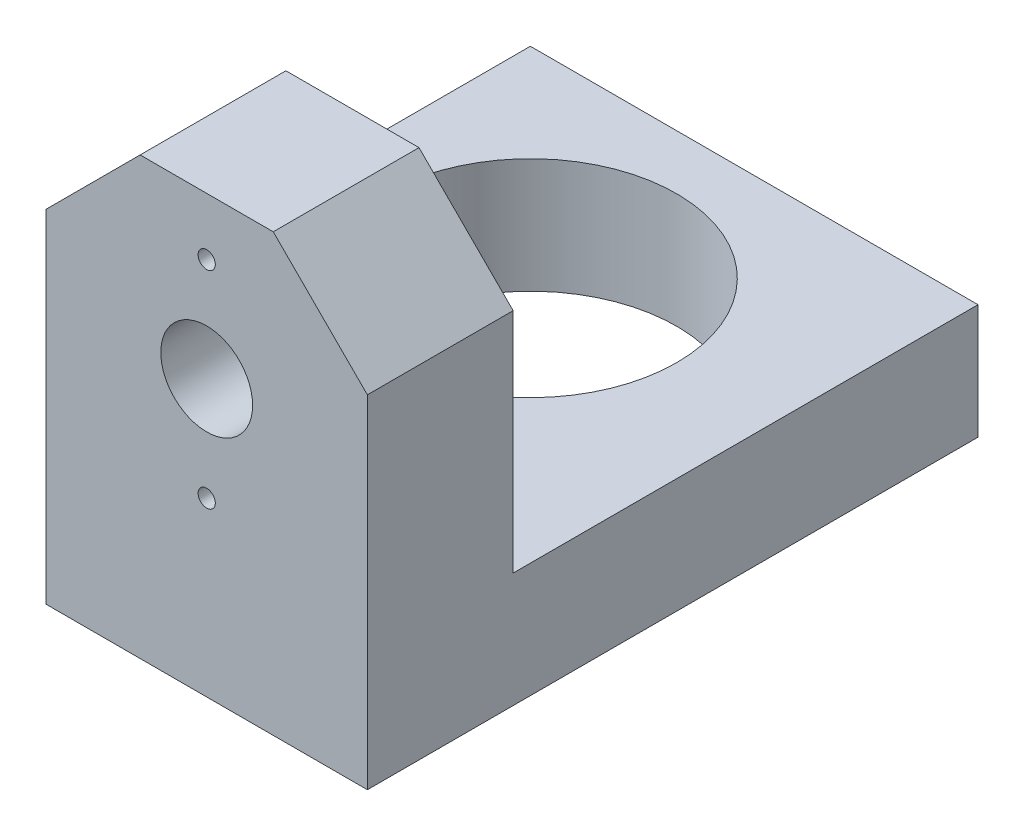
ISO-10303-21;
HEADER;
FILE_DESCRIPTION(('STEP AP214'),'2;1');
FILE_NAME('part.step','',(''),(''),'','','');
FILE_SCHEMA(('AUTOMOTIVE_DESIGN { 1 0 10303 214 1 1 1 1 }'));
ENDSEC;
DATA;
#1=APPLICATION_CONTEXT('core data for automotive mechanical design processes');
#2=APPLICATION_PROTOCOL_DEFINITION('international standard','automotive_design',2000,#1);
#3=PRODUCT_CONTEXT('',#1,'mechanical');
#4=PRODUCT('Part','Part','',(#3));
#5=PRODUCT_RELATED_PRODUCT_CATEGORY('part','',(#4));
#6=PRODUCT_DEFINITION_FORMATION('','',#4);
#7=PRODUCT_DEFINITION_CONTEXT('part definition',#1,'design');
#8=PRODUCT_DEFINITION('design','',#6,#7);
#9=PRODUCT_DEFINITION_SHAPE('','',#8);
#10=(LENGTH_UNIT() NAMED_UNIT(*) SI_UNIT(.MILLI.,.METRE.));
#11=(NAMED_UNIT(*) PLANE_ANGLE_UNIT() SI_UNIT($,.RADIAN.));
#12=(NAMED_UNIT(*) SI_UNIT($,.STERADIAN.) SOLID_ANGLE_UNIT());
#13=UNCERTAINTY_MEASURE_WITH_UNIT(LENGTH_MEASURE(1.E-05),#10,'distance_accuracy_value','');
#14=(GEOMETRIC_REPRESENTATION_CONTEXT(3) GLOBAL_UNCERTAINTY_ASSIGNED_CONTEXT((#13)) GLOBAL_UNIT_ASSIGNED_CONTEXT((#10,
#11,#12)) REPRESENTATION_CONTEXT('',''));
#15=CARTESIAN_POINT('',(0.,0.,0.));
#16=DIRECTION('',(0.,0.,1.));
#17=DIRECTION('',(1.,0.,0.));
#18=AXIS2_PLACEMENT_3D('',#15,#16,#17);
#19=CARTESIAN_POINT('',(0.,0.,12.7));
#20=DIRECTION('',(0.,0.,-1.));
#21=DIRECTION('',(-1.,0.,0.));
#22=AXIS2_PLACEMENT_3D('',#19,#20,#21);
#23=PLANE('',#22);
#24=DIRECTION('',(-0.707106781186549,-0.707106781186546,0.));
#25=VECTOR('',#24,1.);
#26=CARTESIAN_POINT('',(-14.,5.79898987322334,12.7));
#27=LINE('',#26,#25);
#28=CARTESIAN_POINT('',(-5.79898987322334,14.,12.7));
#29=VERTEX_POINT('',#28);
#30=CARTESIAN_POINT('',(-14.,5.79898987322334,12.7));
#31=VERTEX_POINT('',#30);
#32=EDGE_CURVE('E238',#29,#31,#27,.T.);
#33=ORIENTED_EDGE('',*,*,#32,.T.);
#34=DIRECTION('',(0.,-1.,0.));
#35=VECTOR('',#34,1.);
#36=CARTESIAN_POINT('',(-14.,-5.79898987322334,12.7));
#37=LINE('',#36,#35);
#38=CARTESIAN_POINT('',(-14.,-24.,12.7));
#39=VERTEX_POINT('',#38);
#40=EDGE_CURVE('E112',#31,#39,#37,.T.);
#41=ORIENTED_EDGE('',*,*,#40,.T.);
#42=DIRECTION('',(-1.,0.,0.));
#43=VECTOR('',#42,1.);
#44=CARTESIAN_POINT('',(14.,-24.,12.7));
#45=LINE('',#44,#43);
#46=CARTESIAN_POINT('',(14.,-24.,12.7));
#47=VERTEX_POINT('',#46);
#48=EDGE_CURVE('E190',#47,#39,#45,.T.);
#49=ORIENTED_EDGE('',*,*,#48,.F.);
#50=DIRECTION('',(0.,1.,0.));
#51=VECTOR('',#50,1.);
#52=CARTESIAN_POINT('',(14.,-14.,12.7));
#53=LINE('',#52,#51);
#54=CARTESIAN_POINT('',(14.,5.79898987322334,12.7));
#55=VERTEX_POINT('',#54);
#56=EDGE_CURVE('E243',#47,#55,#53,.T.);
#57=ORIENTED_EDGE('',*,*,#56,.T.);
#58=DIRECTION('',(-0.707106781186549,0.707106781186546,0.));
#59=VECTOR('',#58,1.);
#60=CARTESIAN_POINT('',(5.79898987322334,14.,12.7));
#61=LINE('',#60,#59);
#62=CARTESIAN_POINT('',(5.79898987322334,14.,12.7));
#63=VERTEX_POINT('',#62);
#64=EDGE_CURVE('E246',#55,#63,#61,.T.);
#65=ORIENTED_EDGE('',*,*,#64,.T.);
#66=DIRECTION('',(-1.,0.,0.));
#67=VECTOR('',#66,1.);
#68=CARTESIAN_POINT('',(-5.79898987322334,14.,12.7));
#69=LINE('',#68,#67);
#70=EDGE_CURVE('E78',#63,#29,#69,.T.);
#71=ORIENTED_EDGE('',*,*,#70,.T.);
#72=EDGE_LOOP('',(#33,#41,#49,#57,#65,#71));
#73=FACE_BOUND('',#72,.T.);
#74=CARTESIAN_POINT('',(0.,0.,12.7));
#75=DIRECTION('',(0.,0.,1.));
#76=DIRECTION('',(1.,0.,0.));
#77=AXIS2_PLACEMENT_3D('',#74,#75,#76);
#78=CIRCLE('',#77,4.);
#79=CARTESIAN_POINT('',(4.,0.,12.7));
#80=VERTEX_POINT('',#79);
#81=EDGE_CURVE('E230',#80,#80,#78,.T.);
#82=ORIENTED_EDGE('',*,*,#81,.F.);
#83=EDGE_LOOP('',(#82));
#84=FACE_BOUND('',#83,.T.);
#85=CARTESIAN_POINT('',(0.,9.,12.7));
#86=DIRECTION('',(0.,0.,1.));
#87=DIRECTION('',(1.,0.,0.));
#88=AXIS2_PLACEMENT_3D('',#85,#86,#87);
#89=CIRCLE('',#88,0.75);
#90=CARTESIAN_POINT('',(0.75,9.,12.7));
#91=VERTEX_POINT('',#90);
#92=EDGE_CURVE('E222',#91,#91,#89,.T.);
#93=ORIENTED_EDGE('',*,*,#92,.F.);
#94=EDGE_LOOP('',(#93));
#95=FACE_BOUND('',#94,.T.);
#96=CARTESIAN_POINT('',(0.,-9.,12.7));
#97=DIRECTION('',(0.,0.,1.));
#98=DIRECTION('',(1.,0.,0.));
#99=AXIS2_PLACEMENT_3D('',#96,#97,#98);
#100=CIRCLE('',#99,0.75);
#101=CARTESIAN_POINT('',(0.75,-9.,12.7));
#102=VERTEX_POINT('',#101);
#103=EDGE_CURVE('E214',#102,#102,#100,.T.);
#104=ORIENTED_EDGE('',*,*,#103,.F.);
#105=EDGE_LOOP('',(#104));
#106=FACE_BOUND('',#105,.T.);
#107=ADVANCED_FACE('F60',(#73,#84,#95,#106),#23,.F.);
#108=CARTESIAN_POINT('',(0.,0.,0.));
#109=DIRECTION('',(0.,0.,-1.));
#110=DIRECTION('',(-1.,0.,0.));
#111=AXIS2_PLACEMENT_3D('',#108,#109,#110);
#112=PLANE('',#111);
#113=CARTESIAN_POINT('',(0.,9.,0.));
#114=DIRECTION('',(0.,0.,1.));
#115=DIRECTION('',(1.,0.,0.));
#116=AXIS2_PLACEMENT_3D('',#113,#114,#115);
#117=CIRCLE('',#116,0.75);
#118=CARTESIAN_POINT('',(0.75,9.,0.));
#119=VERTEX_POINT('',#118);
#120=EDGE_CURVE('E218',#119,#119,#117,.T.);
#121=ORIENTED_EDGE('',*,*,#120,.T.);
#122=EDGE_LOOP('',(#121));
#123=FACE_BOUND('',#122,.T.);
#124=DIRECTION('',(-0.707106781186549,-0.707106781186546,0.));
#125=VECTOR('',#124,1.);
#126=CARTESIAN_POINT('',(-14.,5.79898987322334,0.));
#127=LINE('',#126,#125);
#128=CARTESIAN_POINT('',(-5.79898987322334,14.,0.));
#129=VERTEX_POINT('',#128);
#130=CARTESIAN_POINT('',(-14.,5.79898987322334,0.));
#131=VERTEX_POINT('',#130);
#132=EDGE_CURVE('E234',#129,#131,#127,.T.);
#133=ORIENTED_EDGE('',*,*,#132,.F.);
#134=DIRECTION('',(-1.,0.,0.));
#135=VECTOR('',#134,1.);
#136=CARTESIAN_POINT('',(-5.79898987322334,14.,0.));
#137=LINE('',#136,#135);
#138=CARTESIAN_POINT('',(5.79898987322334,14.,0.));
#139=VERTEX_POINT('',#138);
#140=EDGE_CURVE('E105',#139,#129,#137,.T.);
#141=ORIENTED_EDGE('',*,*,#140,.F.);
#142=DIRECTION('',(-0.707106781186549,0.707106781186546,0.));
#143=VECTOR('',#142,1.);
#144=CARTESIAN_POINT('',(5.79898987322334,14.,0.));
#145=LINE('',#144,#143);
#146=CARTESIAN_POINT('',(14.,5.79898987322334,0.));
#147=VERTEX_POINT('',#146);
#148=EDGE_CURVE('E99',#147,#139,#145,.T.);
#149=ORIENTED_EDGE('',*,*,#148,.F.);
#150=DIRECTION('',(0.,1.,0.));
#151=VECTOR('',#150,1.);
#152=CARTESIAN_POINT('',(14.,5.79898987322334,0.));
#153=LINE('',#152,#151);
#154=CARTESIAN_POINT('',(14.,-14.,0.));
#155=VERTEX_POINT('',#154);
#156=EDGE_CURVE('E263',#155,#147,#153,.T.);
#157=ORIENTED_EDGE('',*,*,#156,.F.);
#158=DIRECTION('',(1.,0.,0.));
#159=VECTOR('',#158,1.);
#160=CARTESIAN_POINT('',(5.79898987322334,-14.,0.));
#161=LINE('',#160,#159);
#162=CARTESIAN_POINT('',(-14.,-14.,0.));
#163=VERTEX_POINT('',#162);
#164=EDGE_CURVE('E259',#163,#155,#161,.T.);
#165=ORIENTED_EDGE('',*,*,#164,.F.);
#166=DIRECTION('',(0.,-1.,0.));
#167=VECTOR('',#166,1.);
#168=CARTESIAN_POINT('',(-14.,-5.79898987322334,0.));
#169=LINE('',#168,#167);
#170=EDGE_CURVE('E255',#131,#163,#169,.T.);
#171=ORIENTED_EDGE('',*,*,#170,.F.);
#172=EDGE_LOOP('',(#133,#141,#149,#157,#165,#171));
#173=FACE_BOUND('',#172,.T.);
#174=CARTESIAN_POINT('',(0.,0.,0.));
#175=DIRECTION('',(0.,0.,1.));
#176=DIRECTION('',(1.,0.,0.));
#177=AXIS2_PLACEMENT_3D('',#174,#175,#176);
#178=CIRCLE('',#177,4.);
#179=CARTESIAN_POINT('',(4.,0.,0.));
#180=VERTEX_POINT('',#179);
#181=EDGE_CURVE('E226',#180,#180,#178,.T.);
#182=ORIENTED_EDGE('',*,*,#181,.T.);
#183=EDGE_LOOP('',(#182));
#184=FACE_BOUND('',#183,.T.);
#185=CARTESIAN_POINT('',(0.,-9.,0.));
#186=DIRECTION('',(0.,0.,1.));
#187=DIRECTION('',(1.,0.,0.));
#188=AXIS2_PLACEMENT_3D('',#185,#186,#187);
#189=CIRCLE('',#188,0.75);
#190=CARTESIAN_POINT('',(0.75,-9.,0.));
#191=VERTEX_POINT('',#190);
#192=EDGE_CURVE('E207',#191,#191,#189,.T.);
#193=ORIENTED_EDGE('',*,*,#192,.T.);
#194=EDGE_LOOP('',(#193));
#195=FACE_BOUND('',#194,.T.);
#196=ADVANCED_FACE('F281',(#123,#173,#184,#195),#112,.T.);
#197=CARTESIAN_POINT('',(-14.,5.79898987322334,12.7));
#198=DIRECTION('',(0.707106781186546,-0.707106781186549,0.));
#199=DIRECTION('',(0.707106781186549,0.707106781186546,0.));
#200=AXIS2_PLACEMENT_3D('',#197,#198,#199);
#201=PLANE('',#200);
#202=ORIENTED_EDGE('',*,*,#132,.T.);
#203=DIRECTION('',(0.,0.,-1.));
#204=VECTOR('',#203,1.);
#205=CARTESIAN_POINT('',(-14.,5.79898987322334,12.7));
#206=LINE('',#205,#204);
#207=EDGE_CURVE('E12',#31,#131,#206,.T.);
#208=ORIENTED_EDGE('',*,*,#207,.F.);
#209=ORIENTED_EDGE('',*,*,#32,.F.);
#210=DIRECTION('',(0.,0.,-1.));
#211=VECTOR('',#210,1.);
#212=CARTESIAN_POINT('',(-5.79898987322334,14.,12.7));
#213=LINE('',#212,#211);
#214=EDGE_CURVE('E251',#29,#129,#213,.T.);
#215=ORIENTED_EDGE('',*,*,#214,.T.);
#216=EDGE_LOOP('',(#202,#208,#209,#215));
#217=FACE_BOUND('',#216,.T.);
#218=ADVANCED_FACE('F62',(#217),#201,.F.);
#219=CARTESIAN_POINT('',(-14.,-5.79898987322334,12.7));
#220=DIRECTION('',(1.,0.,0.));
#221=DIRECTION('',(0.,0.,-1.));
#222=AXIS2_PLACEMENT_3D('',#219,#220,#221);
#223=PLANE('',#222);
#224=ORIENTED_EDGE('',*,*,#170,.T.);
#225=DIRECTION('',(0.,1.,0.));
#226=VECTOR('',#225,1.);
#227=CARTESIAN_POINT('',(-14.,-24.,0.));
#228=LINE('',#227,#226);
#229=CARTESIAN_POINT('',(-14.,-24.,0.));
#230=VERTEX_POINT('',#229);
#231=EDGE_CURVE('E208',#230,#163,#228,.T.);
#232=ORIENTED_EDGE('',*,*,#231,.F.);
#233=DIRECTION('',(0.,0.,1.));
#234=VECTOR('',#233,1.);
#235=CARTESIAN_POINT('',(-14.,-24.,0.));
#236=LINE('',#235,#234);
#237=EDGE_CURVE('E187',#230,#39,#236,.T.);
#238=ORIENTED_EDGE('',*,*,#237,.T.);
#239=ORIENTED_EDGE('',*,*,#40,.F.);
#240=ORIENTED_EDGE('',*,*,#207,.T.);
#241=EDGE_LOOP('',(#224,#232,#238,#239,#240));
#242=FACE_BOUND('',#241,.T.);
#243=ADVANCED_FACE('F368',(#242),#223,.F.);
#244=CARTESIAN_POINT('',(14.,5.79898987322334,12.7));
#245=DIRECTION('',(-1.,0.,0.));
#246=DIRECTION('',(0.,0.,1.));
#247=AXIS2_PLACEMENT_3D('',#244,#245,#246);
#248=PLANE('',#247);
#249=ORIENTED_EDGE('',*,*,#156,.T.);
#250=DIRECTION('',(0.,0.,-1.));
#251=VECTOR('',#250,1.);
#252=CARTESIAN_POINT('',(14.,5.79898987322334,12.7));
#253=LINE('',#252,#251);
#254=EDGE_CURVE('E70',#55,#147,#253,.T.);
#255=ORIENTED_EDGE('',*,*,#254,.F.);
#256=ORIENTED_EDGE('',*,*,#56,.F.);
#257=DIRECTION('',(0.,0.,1.));
#258=VECTOR('',#257,1.);
#259=CARTESIAN_POINT('',(14.,-24.,-40.5));
#260=LINE('',#259,#258);
#261=CARTESIAN_POINT('',(14.,-24.,-40.5));
#262=VERTEX_POINT('',#261);
#263=EDGE_CURVE('E157',#262,#47,#260,.T.);
#264=ORIENTED_EDGE('',*,*,#263,.F.);
#265=DIRECTION('',(0.,1.,0.));
#266=VECTOR('',#265,1.);
#267=CARTESIAN_POINT('',(14.,-24.,-40.5));
#268=LINE('',#267,#266);
#269=CARTESIAN_POINT('',(14.,-14.,-40.5));
#270=VERTEX_POINT('',#269);
#271=EDGE_CURVE('E172',#262,#270,#268,.T.);
#272=ORIENTED_EDGE('',*,*,#271,.T.);
#273=DIRECTION('',(0.,0.,1.));
#274=VECTOR('',#273,1.);
#275=CARTESIAN_POINT('',(14.,-14.,-40.5));
#276=LINE('',#275,#274);
#277=EDGE_CURVE('E175',#270,#155,#276,.T.);
#278=ORIENTED_EDGE('',*,*,#277,.T.);
#279=EDGE_LOOP('',(#249,#255,#256,#264,#272,#278));
#280=FACE_BOUND('',#279,.T.);
#281=ADVANCED_FACE('F297',(#280),#248,.F.);
#282=CARTESIAN_POINT('',(5.79898987322334,14.,12.7));
#283=DIRECTION('',(-0.707106781186546,-0.707106781186549,0.));
#284=DIRECTION('',(0.707106781186549,-0.707106781186546,0.));
#285=AXIS2_PLACEMENT_3D('',#282,#283,#284);
#286=PLANE('',#285);
#287=ORIENTED_EDGE('',*,*,#148,.T.);
#288=DIRECTION('',(0.,0.,-1.));
#289=VECTOR('',#288,1.);
#290=CARTESIAN_POINT('',(5.79898987322334,14.,12.7));
#291=LINE('',#290,#289);
#292=EDGE_CURVE('E272',#63,#139,#291,.T.);
#293=ORIENTED_EDGE('',*,*,#292,.F.);
#294=ORIENTED_EDGE('',*,*,#64,.F.);
#295=ORIENTED_EDGE('',*,*,#254,.T.);
#296=EDGE_LOOP('',(#287,#293,#294,#295));
#297=FACE_BOUND('',#296,.T.);
#298=ADVANCED_FACE('F277',(#297),#286,.F.);
#299=CARTESIAN_POINT('',(-5.79898987322334,14.,12.7));
#300=DIRECTION('',(0.,-1.,0.));
#301=DIRECTION('',(1.,0.,0.));
#302=AXIS2_PLACEMENT_3D('',#299,#300,#301);
#303=PLANE('',#302);
#304=ORIENTED_EDGE('',*,*,#140,.T.);
#305=ORIENTED_EDGE('',*,*,#214,.F.);
#306=ORIENTED_EDGE('',*,*,#70,.F.);
#307=ORIENTED_EDGE('',*,*,#292,.T.);
#308=EDGE_LOOP('',(#304,#305,#306,#307));
#309=FACE_BOUND('',#308,.T.);
#310=ADVANCED_FACE('F286',(#309),#303,.F.);
#311=CARTESIAN_POINT('',(0.,0.,12.7));
#312=DIRECTION('',(0.,0.,-1.));
#313=DIRECTION('',(-1.,0.,0.));
#314=AXIS2_PLACEMENT_3D('',#311,#312,#313);
#315=CYLINDRICAL_SURFACE('',#314,4.);
#316=ORIENTED_EDGE('',*,*,#81,.T.);
#317=EDGE_LOOP('',(#316));
#318=FACE_BOUND('',#317,.T.);
#319=ORIENTED_EDGE('',*,*,#181,.F.);
#320=EDGE_LOOP('',(#319));
#321=FACE_BOUND('',#320,.T.);
#322=ADVANCED_FACE('F288',(#318,#321),#315,.F.);
#323=CARTESIAN_POINT('',(0.,9.,12.7));
#324=DIRECTION('',(0.,0.,-1.));
#325=DIRECTION('',(-1.,0.,0.));
#326=AXIS2_PLACEMENT_3D('',#323,#324,#325);
#327=CYLINDRICAL_SURFACE('',#326,0.75);
#328=ORIENTED_EDGE('',*,*,#92,.T.);
#329=EDGE_LOOP('',(#328));
#330=FACE_BOUND('',#329,.T.);
#331=ORIENTED_EDGE('',*,*,#120,.F.);
#332=EDGE_LOOP('',(#331));
#333=FACE_BOUND('',#332,.T.);
#334=ADVANCED_FACE('F294',(#330,#333),#327,.F.);
#335=CARTESIAN_POINT('',(0.,-9.,12.7));
#336=DIRECTION('',(0.,0.,-1.));
#337=DIRECTION('',(-1.,0.,0.));
#338=AXIS2_PLACEMENT_3D('',#335,#336,#337);
#339=CYLINDRICAL_SURFACE('',#338,0.75);
#340=ORIENTED_EDGE('',*,*,#103,.T.);
#341=EDGE_LOOP('',(#340));
#342=FACE_BOUND('',#341,.T.);
#343=ORIENTED_EDGE('',*,*,#192,.F.);
#344=EDGE_LOOP('',(#343));
#345=FACE_BOUND('',#344,.T.);
#346=ADVANCED_FACE('F312',(#342,#345),#339,.F.);
#347=CARTESIAN_POINT('',(0.,-24.,0.));
#348=DIRECTION('',(0.,1.,0.));
#349=DIRECTION('',(-1.,0.,0.));
#350=AXIS2_PLACEMENT_3D('',#347,#348,#349);
#351=PLANE('',#350);
#352=DIRECTION('',(-1.,0.,0.));
#353=VECTOR('',#352,1.);
#354=CARTESIAN_POINT('',(14.,-24.,-40.5));
#355=LINE('',#354,#353);
#356=CARTESIAN_POINT('',(-25.,-24.,-40.5));
#357=VERTEX_POINT('',#356);
#358=EDGE_CURVE('E164',#262,#357,#355,.T.);
#359=ORIENTED_EDGE('',*,*,#358,.F.);
#360=ORIENTED_EDGE('',*,*,#263,.T.);
#361=ORIENTED_EDGE('',*,*,#48,.T.);
#362=ORIENTED_EDGE('',*,*,#237,.F.);
#363=DIRECTION('',(-0.707106781186544,0.,-0.707106781186551));
#364=VECTOR('',#363,1.);
#365=CARTESIAN_POINT('',(-14.,-24.,0.));
#366=LINE('',#365,#364);
#367=CARTESIAN_POINT('',(-25.,-24.,-11.0000000000001));
#368=VERTEX_POINT('',#367);
#369=EDGE_CURVE('E167',#230,#368,#366,.T.);
#370=ORIENTED_EDGE('',*,*,#369,.T.);
#371=DIRECTION('',(0.,0.,1.));
#372=VECTOR('',#371,1.);
#373=CARTESIAN_POINT('',(-25.,-24.,-40.5));
#374=LINE('',#373,#372);
#375=EDGE_CURVE('E148',#357,#368,#374,.T.);
#376=ORIENTED_EDGE('',*,*,#375,.F.);
#377=EDGE_LOOP('',(#359,#360,#361,#362,#370,#376));
#378=FACE_BOUND('',#377,.T.);
#379=CARTESIAN_POINT('',(-7.5,-24.,-23.));
#380=DIRECTION('',(0.,-1.,0.));
#381=DIRECTION('',(1.,0.,0.));
#382=AXIS2_PLACEMENT_3D('',#379,#380,#381);
#383=CIRCLE('',#382,12.75);
#384=CARTESIAN_POINT('',(5.25,-24.,-23.));
#385=VERTEX_POINT('',#384);
#386=EDGE_CURVE('E199',#385,#385,#383,.T.);
#387=ORIENTED_EDGE('',*,*,#386,.F.);
#388=EDGE_LOOP('',(#387));
#389=FACE_BOUND('',#388,.T.);
#390=ADVANCED_FACE('F161',(#378,#389),#351,.F.);
#391=CARTESIAN_POINT('',(0.,-14.,0.));
#392=DIRECTION('',(0.,1.,0.));
#393=DIRECTION('',(-1.,0.,0.));
#394=AXIS2_PLACEMENT_3D('',#391,#392,#393);
#395=PLANE('',#394);
#396=DIRECTION('',(-0.707106781186544,0.,-0.707106781186551));
#397=VECTOR('',#396,1.);
#398=CARTESIAN_POINT('',(-14.,-14.,0.));
#399=LINE('',#398,#397);
#400=CARTESIAN_POINT('',(-25.,-14.,-11.0000000000001));
#401=VERTEX_POINT('',#400);
#402=EDGE_CURVE('E179',#163,#401,#399,.T.);
#403=ORIENTED_EDGE('',*,*,#402,.F.);
#404=ORIENTED_EDGE('',*,*,#164,.T.);
#405=ORIENTED_EDGE('',*,*,#277,.F.);
#406=DIRECTION('',(-1.,0.,0.));
#407=VECTOR('',#406,1.);
#408=CARTESIAN_POINT('',(14.,-14.,-40.5));
#409=LINE('',#408,#407);
#410=CARTESIAN_POINT('',(-25.,-14.,-40.5));
#411=VERTEX_POINT('',#410);
#412=EDGE_CURVE('E196',#270,#411,#409,.T.);
#413=ORIENTED_EDGE('',*,*,#412,.T.);
#414=DIRECTION('',(0.,0.,1.));
#415=VECTOR('',#414,1.);
#416=CARTESIAN_POINT('',(-25.,-14.,-40.5));
#417=LINE('',#416,#415);
#418=EDGE_CURVE('E150',#411,#401,#417,.T.);
#419=ORIENTED_EDGE('',*,*,#418,.T.);
#420=EDGE_LOOP('',(#403,#404,#405,#413,#419));
#421=FACE_BOUND('',#420,.T.);
#422=CARTESIAN_POINT('',(-7.5,-14.,-23.));
#423=DIRECTION('',(0.,-1.,0.));
#424=DIRECTION('',(1.,0.,0.));
#425=AXIS2_PLACEMENT_3D('',#422,#423,#424);
#426=CIRCLE('',#425,12.75);
#427=CARTESIAN_POINT('',(5.25,-14.,-23.));
#428=VERTEX_POINT('',#427);
#429=EDGE_CURVE('E182',#428,#428,#426,.T.);
#430=ORIENTED_EDGE('',*,*,#429,.T.);
#431=EDGE_LOOP('',(#430));
#432=FACE_BOUND('',#431,.T.);
#433=ADVANCED_FACE('F319',(#421,#432),#395,.T.);
#434=CARTESIAN_POINT('',(14.,-24.,-40.5));
#435=DIRECTION('',(0.,0.,-1.));
#436=DIRECTION('',(-1.,0.,0.));
#437=AXIS2_PLACEMENT_3D('',#434,#435,#436);
#438=PLANE('',#437);
#439=ORIENTED_EDGE('',*,*,#412,.F.);
#440=ORIENTED_EDGE('',*,*,#271,.F.);
#441=ORIENTED_EDGE('',*,*,#358,.T.);
#442=DIRECTION('',(0.,1.,0.));
#443=VECTOR('',#442,1.);
#444=CARTESIAN_POINT('',(-25.,-24.,-40.5));
#445=LINE('',#444,#443);
#446=EDGE_CURVE('E145',#357,#411,#445,.T.);
#447=ORIENTED_EDGE('',*,*,#446,.T.);
#448=EDGE_LOOP('',(#439,#440,#441,#447));
#449=FACE_BOUND('',#448,.T.);
#450=ADVANCED_FACE('F171',(#449),#438,.T.);
#451=CARTESIAN_POINT('',(-14.,-24.,0.));
#452=DIRECTION('',(0.707106781186551,0.,-0.707106781186544));
#453=DIRECTION('',(-0.707106781186544,0.,-0.707106781186551));
#454=AXIS2_PLACEMENT_3D('',#451,#452,#453);
#455=PLANE('',#454);
#456=ORIENTED_EDGE('',*,*,#402,.T.);
#457=DIRECTION('',(0.,1.,0.));
#458=VECTOR('',#457,1.);
#459=CARTESIAN_POINT('',(-25.,-24.,-11.0000000000001));
#460=LINE('',#459,#458);
#461=EDGE_CURVE('E156',#368,#401,#460,.T.);
#462=ORIENTED_EDGE('',*,*,#461,.F.);
#463=ORIENTED_EDGE('',*,*,#369,.F.);
#464=ORIENTED_EDGE('',*,*,#231,.T.);
#465=EDGE_LOOP('',(#456,#462,#463,#464));
#466=FACE_BOUND('',#465,.T.);
#467=ADVANCED_FACE('F318',(#466),#455,.F.);
#468=CARTESIAN_POINT('',(-25.,-24.,-40.5));
#469=DIRECTION('',(-1.,0.,0.));
#470=DIRECTION('',(0.,-1.,0.));
#471=AXIS2_PLACEMENT_3D('',#468,#469,#470);
#472=PLANE('',#471);
#473=ORIENTED_EDGE('',*,*,#418,.F.);
#474=ORIENTED_EDGE('',*,*,#446,.F.);
#475=ORIENTED_EDGE('',*,*,#375,.T.);
#476=ORIENTED_EDGE('',*,*,#461,.T.);
#477=EDGE_LOOP('',(#473,#474,#475,#476));
#478=FACE_BOUND('',#477,.T.);
#479=ADVANCED_FACE('F147',(#478),#472,.T.);
#480=CARTESIAN_POINT('',(-7.5,-24.,-23.));
#481=DIRECTION('',(0.,1.,0.));
#482=DIRECTION('',(-1.,0.,0.));
#483=AXIS2_PLACEMENT_3D('',#480,#481,#482);
#484=CYLINDRICAL_SURFACE('',#483,12.75);
#485=ORIENTED_EDGE('',*,*,#386,.T.);
#486=EDGE_LOOP('',(#485));
#487=FACE_BOUND('',#486,.T.);
#488=ORIENTED_EDGE('',*,*,#429,.F.);
#489=EDGE_LOOP('',(#488));
#490=FACE_BOUND('',#489,.T.);
#491=ADVANCED_FACE('F322',(#487,#490),#484,.F.);
#492=CLOSED_SHELL('',(#107,#196,#218,#243,#281,#298,#310,#322,#334,#346,#390,#433,#450,#467,
#479,#491));
#493=MANIFOLD_SOLID_BREP('B2',#492);
#494=ADVANCED_BREP_SHAPE_REPRESENTATION('',(#18,#493),#14);
#495=SHAPE_DEFINITION_REPRESENTATION(#9,#494);
ENDSEC;
END-ISO-10303-21;
